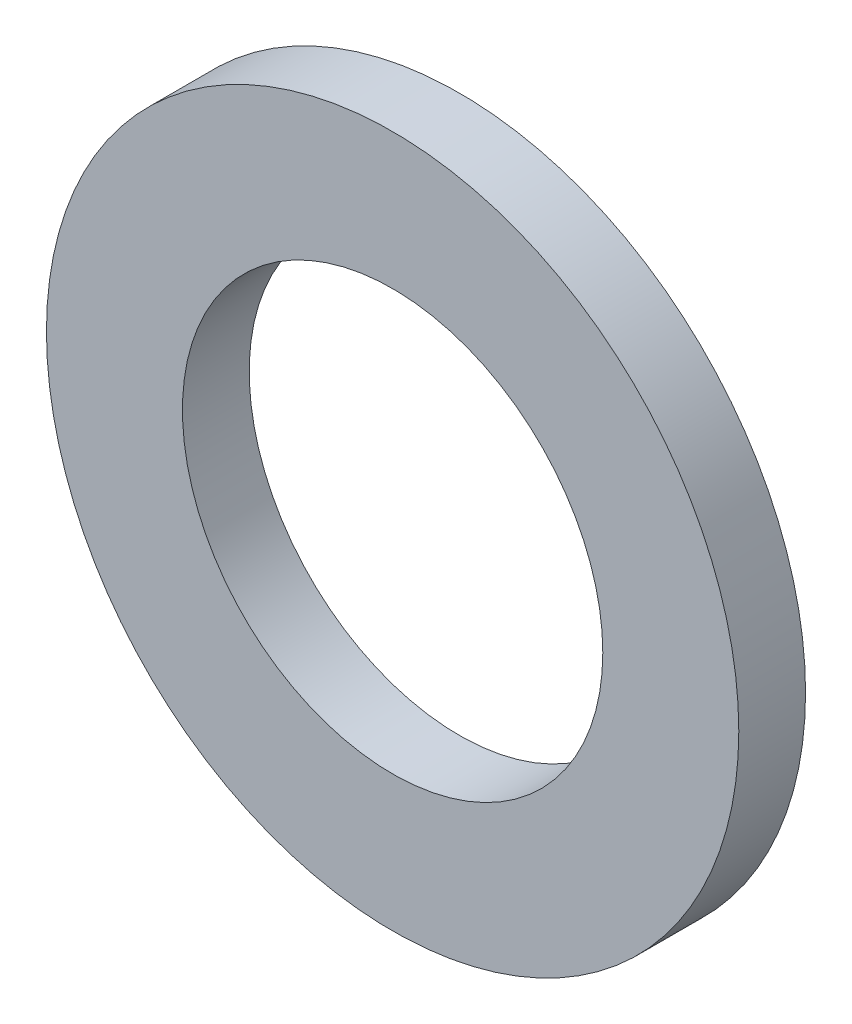
ISO-10303-21;
HEADER;
FILE_DESCRIPTION(('STEP AP214'),'2;1');
FILE_NAME('part.step','',(''),(''),'','','');
FILE_SCHEMA(('AUTOMOTIVE_DESIGN { 1 0 10303 214 1 1 1 1 }'));
ENDSEC;
DATA;
#1=APPLICATION_CONTEXT('core data for automotive mechanical design processes');
#2=APPLICATION_PROTOCOL_DEFINITION('international standard','automotive_design',2000,#1);
#3=PRODUCT_CONTEXT('',#1,'mechanical');
#4=PRODUCT('Part','Part','',(#3));
#5=PRODUCT_RELATED_PRODUCT_CATEGORY('part','',(#4));
#6=PRODUCT_DEFINITION_FORMATION('','',#4);
#7=PRODUCT_DEFINITION_CONTEXT('part definition',#1,'design');
#8=PRODUCT_DEFINITION('design','',#6,#7);
#9=PRODUCT_DEFINITION_SHAPE('','',#8);
#10=(LENGTH_UNIT() NAMED_UNIT(*) SI_UNIT(.MILLI.,.METRE.));
#11=(NAMED_UNIT(*) PLANE_ANGLE_UNIT() SI_UNIT($,.RADIAN.));
#12=(NAMED_UNIT(*) SI_UNIT($,.STERADIAN.) SOLID_ANGLE_UNIT());
#13=UNCERTAINTY_MEASURE_WITH_UNIT(LENGTH_MEASURE(1.E-05),#10,'distance_accuracy_value','');
#14=(GEOMETRIC_REPRESENTATION_CONTEXT(3) GLOBAL_UNCERTAINTY_ASSIGNED_CONTEXT((#13)) GLOBAL_UNIT_ASSIGNED_CONTEXT((#10,
#11,#12)) REPRESENTATION_CONTEXT('',''));
#15=CARTESIAN_POINT('',(0.,0.,0.));
#16=DIRECTION('',(0.,0.,1.));
#17=DIRECTION('',(1.,0.,0.));
#18=AXIS2_PLACEMENT_3D('',#15,#16,#17);
#19=CARTESIAN_POINT('',(0.,0.,2.7));
#20=DIRECTION('',(0.,0.,1.));
#21=DIRECTION('',(1.,0.,0.));
#22=AXIS2_PLACEMENT_3D('',#19,#20,#21);
#23=PLANE('',#22);
#24=CARTESIAN_POINT('',(0.,0.,2.7));
#25=DIRECTION('',(0.,0.,1.));
#26=DIRECTION('',(1.,0.,0.));
#27=AXIS2_PLACEMENT_3D('',#24,#25,#26);
#28=CIRCLE('',#27,14.);
#29=CARTESIAN_POINT('',(14.,0.,2.7));
#30=VERTEX_POINT('',#29);
#31=EDGE_CURVE('E10',#30,#30,#28,.T.);
#32=ORIENTED_EDGE('',*,*,#31,.T.);
#33=EDGE_LOOP('',(#32));
#34=FACE_BOUND('',#33,.T.);
#35=CARTESIAN_POINT('',(0.,0.,2.7));
#36=DIRECTION('',(0.,0.,1.));
#37=DIRECTION('',(1.,0.,0.));
#38=AXIS2_PLACEMENT_3D('',#35,#36,#37);
#39=CIRCLE('',#38,8.5);
#40=CARTESIAN_POINT('',(8.5,0.,2.7));
#41=VERTEX_POINT('',#40);
#42=EDGE_CURVE('E43',#41,#41,#39,.T.);
#43=ORIENTED_EDGE('',*,*,#42,.F.);
#44=EDGE_LOOP('',(#43));
#45=FACE_BOUND('',#44,.T.);
#46=ADVANCED_FACE('F32',(#34,#45),#23,.T.);
#47=CARTESIAN_POINT('',(0.,0.,0.));
#48=DIRECTION('',(0.,0.,1.));
#49=DIRECTION('',(1.,0.,0.));
#50=AXIS2_PLACEMENT_3D('',#47,#48,#49);
#51=PLANE('',#50);
#52=CARTESIAN_POINT('',(0.,0.,0.));
#53=DIRECTION('',(0.,0.,1.));
#54=DIRECTION('',(1.,0.,0.));
#55=AXIS2_PLACEMENT_3D('',#52,#53,#54);
#56=CIRCLE('',#55,14.);
#57=CARTESIAN_POINT('',(14.,0.,0.));
#58=VERTEX_POINT('',#57);
#59=EDGE_CURVE('E36',#58,#58,#56,.T.);
#60=ORIENTED_EDGE('',*,*,#59,.F.);
#61=EDGE_LOOP('',(#60));
#62=FACE_BOUND('',#61,.T.);
#63=CARTESIAN_POINT('',(0.,0.,0.));
#64=DIRECTION('',(0.,0.,1.));
#65=DIRECTION('',(1.,0.,0.));
#66=AXIS2_PLACEMENT_3D('',#63,#64,#65);
#67=CIRCLE('',#66,8.5);
#68=CARTESIAN_POINT('',(8.5,0.,0.));
#69=VERTEX_POINT('',#68);
#70=EDGE_CURVE('E45',#69,#69,#67,.T.);
#71=ORIENTED_EDGE('',*,*,#70,.T.);
#72=EDGE_LOOP('',(#71));
#73=FACE_BOUND('',#72,.T.);
#74=ADVANCED_FACE('F55',(#62,#73),#51,.F.);
#75=CARTESIAN_POINT('',(0.,0.,2.7));
#76=DIRECTION('',(0.,0.,-1.));
#77=DIRECTION('',(-1.,0.,0.));
#78=AXIS2_PLACEMENT_3D('',#75,#76,#77);
#79=CYLINDRICAL_SURFACE('',#78,14.);
#80=ORIENTED_EDGE('',*,*,#31,.F.);
#81=EDGE_LOOP('',(#80));
#82=FACE_BOUND('',#81,.T.);
#83=ORIENTED_EDGE('',*,*,#59,.T.);
#84=EDGE_LOOP('',(#83));
#85=FACE_BOUND('',#84,.T.);
#86=ADVANCED_FACE('F34',(#82,#85),#79,.T.);
#87=CARTESIAN_POINT('',(0.,0.,2.7));
#88=DIRECTION('',(0.,0.,-1.));
#89=DIRECTION('',(-1.,0.,0.));
#90=AXIS2_PLACEMENT_3D('',#87,#88,#89);
#91=CYLINDRICAL_SURFACE('',#90,8.5);
#92=ORIENTED_EDGE('',*,*,#42,.T.);
#93=EDGE_LOOP('',(#92));
#94=FACE_BOUND('',#93,.T.);
#95=ORIENTED_EDGE('',*,*,#70,.F.);
#96=EDGE_LOOP('',(#95));
#97=FACE_BOUND('',#96,.T.);
#98=ADVANCED_FACE('F51',(#94,#97),#91,.F.);
#99=CLOSED_SHELL('',(#46,#74,#86,#98));
#100=MANIFOLD_SOLID_BREP('B2',#99);
#101=ADVANCED_BREP_SHAPE_REPRESENTATION('',(#18,#100),#14);
#102=SHAPE_DEFINITION_REPRESENTATION(#9,#101);
ENDSEC;
END-ISO-10303-21;
